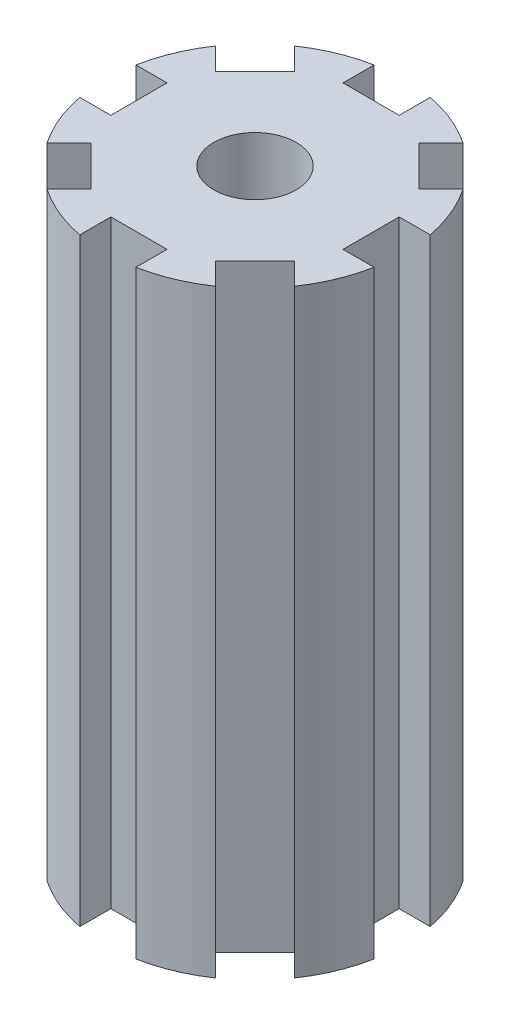
ISO-10303-21;
HEADER;
FILE_DESCRIPTION(('STEP AP214'),'2;1');
FILE_NAME('part.step','',(''),(''),'','','');
FILE_SCHEMA(('AUTOMOTIVE_DESIGN { 1 0 10303 214 1 1 1 1 }'));
ENDSEC;
DATA;
#1=APPLICATION_CONTEXT('core data for automotive mechanical design processes');
#2=APPLICATION_PROTOCOL_DEFINITION('international standard','automotive_design',2000,#1);
#3=PRODUCT_CONTEXT('',#1,'mechanical');
#4=PRODUCT('Part','Part','',(#3));
#5=PRODUCT_RELATED_PRODUCT_CATEGORY('part','',(#4));
#6=PRODUCT_DEFINITION_FORMATION('','',#4);
#7=PRODUCT_DEFINITION_CONTEXT('part definition',#1,'design');
#8=PRODUCT_DEFINITION('design','',#6,#7);
#9=PRODUCT_DEFINITION_SHAPE('','',#8);
#10=(LENGTH_UNIT() NAMED_UNIT(*) SI_UNIT(.MILLI.,.METRE.));
#11=(NAMED_UNIT(*) PLANE_ANGLE_UNIT() SI_UNIT($,.RADIAN.));
#12=(NAMED_UNIT(*) SI_UNIT($,.STERADIAN.) SOLID_ANGLE_UNIT());
#13=UNCERTAINTY_MEASURE_WITH_UNIT(LENGTH_MEASURE(1.E-05),#10,'distance_accuracy_value','');
#14=(GEOMETRIC_REPRESENTATION_CONTEXT(3) GLOBAL_UNCERTAINTY_ASSIGNED_CONTEXT((#13)) GLOBAL_UNIT_ASSIGNED_CONTEXT((#10,
#11,#12)) REPRESENTATION_CONTEXT('',''));
#15=CARTESIAN_POINT('',(0.,0.,0.));
#16=DIRECTION('',(0.,0.,1.));
#17=DIRECTION('',(1.,0.,0.));
#18=AXIS2_PLACEMENT_3D('',#15,#16,#17);
#19=CARTESIAN_POINT('',(0.,-50.8,0.));
#20=DIRECTION('',(0.,1.,0.));
#21=DIRECTION('',(0.,0.,1.));
#22=AXIS2_PLACEMENT_3D('',#19,#20,#21);
#23=CYLINDRICAL_SURFACE('',#22,12.7);
#24=DIRECTION('',(0.,1.,0.));
#25=VECTOR('',#24,1.);
#26=CARTESIAN_POINT('',(7.13718968949764,-50.8,-10.5047857348986));
#27=LINE('',#26,#25);
#28=CARTESIAN_POINT('',(7.13718968949764,-50.8,-10.5047857348986));
#29=VERTEX_POINT('',#28);
#30=CARTESIAN_POINT('',(7.13718968949764,0.,-10.5047857348986));
#31=VERTEX_POINT('',#30);
#32=EDGE_CURVE('E516',#29,#31,#27,.T.);
#33=ORIENTED_EDGE('',*,*,#32,.F.);
#34=CARTESIAN_POINT('',(0.,-50.8,0.));
#35=DIRECTION('',(0.,1.,0.));
#36=DIRECTION('',(0.,0.,1.));
#37=AXIS2_PLACEMENT_3D('',#34,#35,#36);
#38=CIRCLE('',#37,12.7);
#39=CARTESIAN_POINT('',(2.38125,-50.8,-12.474760456117));
#40=VERTEX_POINT('',#39);
#41=EDGE_CURVE('E660',#29,#40,#38,.T.);
#42=ORIENTED_EDGE('',*,*,#41,.T.);
#43=DIRECTION('',(0.,1.,0.));
#44=VECTOR('',#43,1.);
#45=CARTESIAN_POINT('',(2.38125,-50.8,-12.474760456117));
#46=LINE('',#45,#44);
#47=CARTESIAN_POINT('',(2.38125,0.,-12.474760456117));
#48=VERTEX_POINT('',#47);
#49=EDGE_CURVE('E491',#48,#40,#46,.F.);
#50=ORIENTED_EDGE('',*,*,#49,.F.);
#51=CARTESIAN_POINT('',(0.,0.,0.));
#52=DIRECTION('',(0.,1.,0.));
#53=DIRECTION('',(0.,0.,1.));
#54=AXIS2_PLACEMENT_3D('',#51,#52,#53);
#55=CIRCLE('',#54,12.7);
#56=EDGE_CURVE('E579',#31,#48,#55,.T.);
#57=ORIENTED_EDGE('',*,*,#56,.F.);
#58=EDGE_LOOP('',(#33,#42,#50,#57));
#59=FACE_BOUND('',#58,.T.);
#60=ADVANCED_FACE('F39',(#59),#23,.T.);
#61=DIRECTION('',(0.,1.,0.));
#62=VECTOR('',#61,1.);
#63=CARTESIAN_POINT('',(-2.38125,-50.8,-12.474760456117));
#64=LINE('',#63,#62);
#65=CARTESIAN_POINT('',(-2.38125,-50.8,-12.474760456117));
#66=VERTEX_POINT('',#65);
#67=CARTESIAN_POINT('',(-2.38125,0.,-12.474760456117));
#68=VERTEX_POINT('',#67);
#69=EDGE_CURVE('E498',#66,#68,#64,.T.);
#70=ORIENTED_EDGE('',*,*,#69,.F.);
#71=CARTESIAN_POINT('',(-7.13718968949764,-50.8,-10.5047857348986));
#72=VERTEX_POINT('',#71);
#73=EDGE_CURVE('E572',#66,#72,#38,.T.);
#74=ORIENTED_EDGE('',*,*,#73,.T.);
#75=DIRECTION('',(0.,1.,0.));
#76=VECTOR('',#75,1.);
#77=CARTESIAN_POINT('',(-7.13718968949764,-50.8,-10.5047857348986));
#78=LINE('',#77,#76);
#79=CARTESIAN_POINT('',(-7.13718968949764,0.,-10.5047857348986));
#80=VERTEX_POINT('',#79);
#81=EDGE_CURVE('E473',#80,#72,#78,.F.);
#82=ORIENTED_EDGE('',*,*,#81,.F.);
#83=EDGE_CURVE('E576',#68,#80,#55,.T.);
#84=ORIENTED_EDGE('',*,*,#83,.F.);
#85=EDGE_LOOP('',(#70,#74,#82,#84));
#86=FACE_BOUND('',#85,.T.);
#87=ADVANCED_FACE('F574',(#86),#23,.T.);
#88=DIRECTION('',(0.,1.,0.));
#89=VECTOR('',#88,1.);
#90=CARTESIAN_POINT('',(-10.5047857348986,-50.8,-7.13718968949764));
#91=LINE('',#90,#89);
#92=CARTESIAN_POINT('',(-10.5047857348986,-50.8,-7.13718968949764));
#93=VERTEX_POINT('',#92);
#94=CARTESIAN_POINT('',(-10.5047857348986,0.,-7.13718968949764));
#95=VERTEX_POINT('',#94);
#96=EDGE_CURVE('E480',#93,#95,#91,.T.);
#97=ORIENTED_EDGE('',*,*,#96,.F.);
#98=CARTESIAN_POINT('',(-12.474760456117,-50.8,-2.38125));
#99=VERTEX_POINT('',#98);
#100=EDGE_CURVE('E970',#93,#99,#38,.T.);
#101=ORIENTED_EDGE('',*,*,#100,.T.);
#102=DIRECTION('',(0.,1.,0.));
#103=VECTOR('',#102,1.);
#104=CARTESIAN_POINT('',(-12.474760456117,-50.8,-2.38125));
#105=LINE('',#104,#103);
#106=CARTESIAN_POINT('',(-12.474760456117,0.,-2.38125));
#107=VERTEX_POINT('',#106);
#108=EDGE_CURVE('E382',#107,#99,#105,.F.);
#109=ORIENTED_EDGE('',*,*,#108,.F.);
#110=EDGE_CURVE('E580',#95,#107,#55,.T.);
#111=ORIENTED_EDGE('',*,*,#110,.F.);
#112=EDGE_LOOP('',(#97,#101,#109,#111));
#113=FACE_BOUND('',#112,.T.);
#114=ADVANCED_FACE('F676',(#113),#23,.T.);
#115=DIRECTION('',(0.,1.,0.));
#116=VECTOR('',#115,1.);
#117=CARTESIAN_POINT('',(10.5047857348986,-50.8,-7.13718968949764));
#118=LINE('',#117,#116);
#119=CARTESIAN_POINT('',(10.5047857348986,0.,-7.13718968949764));
#120=VERTEX_POINT('',#119);
#121=CARTESIAN_POINT('',(10.5047857348986,-50.8,-7.13718968949764));
#122=VERTEX_POINT('',#121);
#123=EDGE_CURVE('E509',#120,#122,#118,.F.);
#124=ORIENTED_EDGE('',*,*,#123,.F.);
#125=CARTESIAN_POINT('',(12.474760456117,0.,-2.38125));
#126=VERTEX_POINT('',#125);
#127=EDGE_CURVE('E583',#126,#120,#55,.T.);
#128=ORIENTED_EDGE('',*,*,#127,.F.);
#129=DIRECTION('',(0.,1.,0.));
#130=VECTOR('',#129,1.);
#131=CARTESIAN_POINT('',(12.474760456117,-50.8,-2.38125));
#132=LINE('',#131,#130);
#133=CARTESIAN_POINT('',(12.474760456117,-50.8,-2.38125));
#134=VERTEX_POINT('',#133);
#135=EDGE_CURVE('E458',#134,#126,#132,.T.);
#136=ORIENTED_EDGE('',*,*,#135,.F.);
#137=EDGE_CURVE('E649',#134,#122,#38,.T.);
#138=ORIENTED_EDGE('',*,*,#137,.T.);
#139=EDGE_LOOP('',(#124,#128,#136,#138));
#140=FACE_BOUND('',#139,.T.);
#141=ADVANCED_FACE('F646',(#140),#23,.T.);
#142=DIRECTION('',(0.,1.,0.));
#143=VECTOR('',#142,1.);
#144=CARTESIAN_POINT('',(12.474760456117,-50.8,2.38125));
#145=LINE('',#144,#143);
#146=CARTESIAN_POINT('',(12.474760456117,0.,2.38125));
#147=VERTEX_POINT('',#146);
#148=CARTESIAN_POINT('',(12.474760456117,-50.8,2.38125));
#149=VERTEX_POINT('',#148);
#150=EDGE_CURVE('E451',#147,#149,#145,.F.);
#151=ORIENTED_EDGE('',*,*,#150,.F.);
#152=CARTESIAN_POINT('',(10.5047857348986,0.,7.13718968949764));
#153=VERTEX_POINT('',#152);
#154=EDGE_CURVE('E279',#153,#147,#55,.T.);
#155=ORIENTED_EDGE('',*,*,#154,.F.);
#156=DIRECTION('',(0.,1.,0.));
#157=VECTOR('',#156,1.);
#158=CARTESIAN_POINT('',(10.5047857348986,-50.8,7.13718968949764));
#159=LINE('',#158,#157);
#160=CARTESIAN_POINT('',(10.5047857348986,-50.8,7.13718968949764));
#161=VERTEX_POINT('',#160);
#162=EDGE_CURVE('E443',#161,#153,#159,.T.);
#163=ORIENTED_EDGE('',*,*,#162,.F.);
#164=EDGE_CURVE('E525',#161,#149,#38,.T.);
#165=ORIENTED_EDGE('',*,*,#164,.T.);
#166=EDGE_LOOP('',(#151,#155,#163,#165));
#167=FACE_BOUND('',#166,.T.);
#168=ADVANCED_FACE('F635',(#167),#23,.T.);
#169=DIRECTION('',(0.,1.,0.));
#170=VECTOR('',#169,1.);
#171=CARTESIAN_POINT('',(7.13718968949764,-50.8,10.5047857348986));
#172=LINE('',#171,#170);
#173=CARTESIAN_POINT('',(7.13718968949764,0.,10.5047857348986));
#174=VERTEX_POINT('',#173);
#175=CARTESIAN_POINT('',(7.13718968949764,-50.8,10.5047857348986));
#176=VERTEX_POINT('',#175);
#177=EDGE_CURVE('E436',#174,#176,#172,.F.);
#178=ORIENTED_EDGE('',*,*,#177,.F.);
#179=CARTESIAN_POINT('',(2.38125,0.,12.474760456117));
#180=VERTEX_POINT('',#179);
#181=EDGE_CURVE('E527',#180,#174,#55,.T.);
#182=ORIENTED_EDGE('',*,*,#181,.F.);
#183=DIRECTION('',(0.,1.,0.));
#184=VECTOR('',#183,1.);
#185=CARTESIAN_POINT('',(2.38125,-50.8,12.474760456117));
#186=LINE('',#185,#184);
#187=CARTESIAN_POINT('',(2.38125,-50.8,12.474760456117));
#188=VERTEX_POINT('',#187);
#189=EDGE_CURVE('E425',#188,#180,#186,.T.);
#190=ORIENTED_EDGE('',*,*,#189,.F.);
#191=EDGE_CURVE('E520',#188,#176,#38,.T.);
#192=ORIENTED_EDGE('',*,*,#191,.T.);
#193=EDGE_LOOP('',(#178,#182,#190,#192));
#194=FACE_BOUND('',#193,.T.);
#195=ADVANCED_FACE('F622',(#194),#23,.T.);
#196=DIRECTION('',(0.,1.,0.));
#197=VECTOR('',#196,1.);
#198=CARTESIAN_POINT('',(-2.38125,-50.8,12.474760456117));
#199=LINE('',#198,#197);
#200=CARTESIAN_POINT('',(-2.38125,0.,12.474760456117));
#201=VERTEX_POINT('',#200);
#202=CARTESIAN_POINT('',(-2.38125,-50.8,12.474760456117));
#203=VERTEX_POINT('',#202);
#204=EDGE_CURVE('E418',#201,#203,#199,.F.);
#205=ORIENTED_EDGE('',*,*,#204,.F.);
#206=CARTESIAN_POINT('',(-7.13718968949764,0.,10.5047857348986));
#207=VERTEX_POINT('',#206);
#208=EDGE_CURVE('E519',#207,#201,#55,.T.);
#209=ORIENTED_EDGE('',*,*,#208,.F.);
#210=DIRECTION('',(0.,1.,0.));
#211=VECTOR('',#210,1.);
#212=CARTESIAN_POINT('',(-7.13718968949764,-50.8,10.5047857348986));
#213=LINE('',#212,#211);
#214=CARTESIAN_POINT('',(-7.13718968949764,-50.8,10.5047857348986));
#215=VERTEX_POINT('',#214);
#216=EDGE_CURVE('E407',#215,#207,#213,.T.);
#217=ORIENTED_EDGE('',*,*,#216,.F.);
#218=EDGE_CURVE('E526',#215,#203,#38,.T.);
#219=ORIENTED_EDGE('',*,*,#218,.T.);
#220=EDGE_LOOP('',(#205,#209,#217,#219));
#221=FACE_BOUND('',#220,.T.);
#222=ADVANCED_FACE('F604',(#221),#23,.T.);
#223=DIRECTION('',(0.,1.,0.));
#224=VECTOR('',#223,1.);
#225=CARTESIAN_POINT('',(-10.5047857348986,-50.8,7.13718968949764));
#226=LINE('',#225,#224);
#227=CARTESIAN_POINT('',(-10.5047857348986,0.,7.13718968949764));
#228=VERTEX_POINT('',#227);
#229=CARTESIAN_POINT('',(-10.5047857348986,-50.8,7.13718968949764));
#230=VERTEX_POINT('',#229);
#231=EDGE_CURVE('E400',#228,#230,#226,.F.);
#232=ORIENTED_EDGE('',*,*,#231,.F.);
#233=CARTESIAN_POINT('',(-12.474760456117,0.,2.38125));
#234=VERTEX_POINT('',#233);
#235=EDGE_CURVE('E585',#234,#228,#55,.T.);
#236=ORIENTED_EDGE('',*,*,#235,.F.);
#237=DIRECTION('',(0.,1.,0.));
#238=VECTOR('',#237,1.);
#239=CARTESIAN_POINT('',(-12.474760456117,-50.8,2.38125));
#240=LINE('',#239,#238);
#241=CARTESIAN_POINT('',(-12.474760456117,-50.8,2.38125));
#242=VERTEX_POINT('',#241);
#243=EDGE_CURVE('E389',#242,#234,#240,.T.);
#244=ORIENTED_EDGE('',*,*,#243,.F.);
#245=EDGE_CURVE('E688',#242,#230,#38,.T.);
#246=ORIENTED_EDGE('',*,*,#245,.T.);
#247=EDGE_LOOP('',(#232,#236,#244,#246));
#248=FACE_BOUND('',#247,.T.);
#249=ADVANCED_FACE('F41',(#248),#23,.T.);
#250=CARTESIAN_POINT('',(0.,-50.8,0.));
#251=DIRECTION('',(0.,1.,0.));
#252=DIRECTION('',(0.,0.,1.));
#253=AXIS2_PLACEMENT_3D('',#250,#251,#252);
#254=PLANE('',#253);
#255=ORIENTED_EDGE('',*,*,#41,.F.);
#256=DIRECTION('',(-0.707106781186547,0.,0.707106781186548));
#257=VECTOR('',#256,1.);
#258=CARTESIAN_POINT('',(-1.68379802270047,-50.8,-1.68379802270047));
#259=LINE('',#258,#257);
#260=CARTESIAN_POINT('',(5.27590047112812,-50.8,-8.64349651652906));
#261=VERTEX_POINT('',#260);
#262=EDGE_CURVE('E512',#29,#261,#259,.T.);
#263=ORIENTED_EDGE('',*,*,#262,.T.);
#264=DIRECTION('',(0.707106781186548,0.,0.707106781186548));
#265=VECTOR('',#264,1.);
#266=CARTESIAN_POINT('',(6.95969849382859,-50.8,-6.95969849382859));
#267=LINE('',#266,#265);
#268=CARTESIAN_POINT('',(8.64349651652905,-50.8,-5.27590047112813));
#269=VERTEX_POINT('',#268);
#270=EDGE_CURVE('E501',#261,#269,#267,.T.);
#271=ORIENTED_EDGE('',*,*,#270,.T.);
#272=DIRECTION('',(0.707106781186548,0.,-0.707106781186547));
#273=VECTOR('',#272,1.);
#274=CARTESIAN_POINT('',(1.68379802270046,-50.8,1.68379802270046));
#275=LINE('',#274,#273);
#276=EDGE_CURVE('E505',#269,#122,#275,.T.);
#277=ORIENTED_EDGE('',*,*,#276,.T.);
#278=ORIENTED_EDGE('',*,*,#137,.F.);
#279=DIRECTION('',(-1.,0.,0.));
#280=VECTOR('',#279,1.);
#281=CARTESIAN_POINT('',(0.,-50.8,-2.38125));
#282=LINE('',#281,#280);
#283=CARTESIAN_POINT('',(9.8425,-50.8,-2.38125));
#284=VERTEX_POINT('',#283);
#285=EDGE_CURVE('E454',#134,#284,#282,.T.);
#286=ORIENTED_EDGE('',*,*,#285,.T.);
#287=DIRECTION('',(0.,0.,1.));
#288=VECTOR('',#287,1.);
#289=CARTESIAN_POINT('',(9.8425,-50.8,0.));
#290=LINE('',#289,#288);
#291=CARTESIAN_POINT('',(9.8425,-50.8,2.38125));
#292=VERTEX_POINT('',#291);
#293=EDGE_CURVE('E446',#284,#292,#290,.T.);
#294=ORIENTED_EDGE('',*,*,#293,.T.);
#295=DIRECTION('',(1.,0.,0.));
#296=VECTOR('',#295,1.);
#297=CARTESIAN_POINT('',(0.,-50.8,2.38125));
#298=LINE('',#297,#296);
#299=EDGE_CURVE('E256',#292,#149,#298,.T.);
#300=ORIENTED_EDGE('',*,*,#299,.T.);
#301=ORIENTED_EDGE('',*,*,#164,.F.);
#302=DIRECTION('',(-0.707106781186548,0.,-0.707106781186547));
#303=VECTOR('',#302,1.);
#304=CARTESIAN_POINT('',(1.68379802270046,-50.8,-1.68379802270047));
#305=LINE('',#304,#303);
#306=CARTESIAN_POINT('',(8.64349651652906,-50.8,5.27590047112812));
#307=VERTEX_POINT('',#306);
#308=EDGE_CURVE('E439',#161,#307,#305,.T.);
#309=ORIENTED_EDGE('',*,*,#308,.T.);
#310=DIRECTION('',(-0.707106781186548,0.,0.707106781186548));
#311=VECTOR('',#310,1.);
#312=CARTESIAN_POINT('',(6.95969849382859,-50.8,6.95969849382859));
#313=LINE('',#312,#311);
#314=CARTESIAN_POINT('',(5.27590047112812,-50.8,8.64349651652906));
#315=VERTEX_POINT('',#314);
#316=EDGE_CURVE('E428',#307,#315,#313,.T.);
#317=ORIENTED_EDGE('',*,*,#316,.T.);
#318=DIRECTION('',(0.707106781186547,0.,0.707106781186548));
#319=VECTOR('',#318,1.);
#320=CARTESIAN_POINT('',(-1.68379802270047,-50.8,1.68379802270046));
#321=LINE('',#320,#319);
#322=EDGE_CURVE('E432',#315,#176,#321,.T.);
#323=ORIENTED_EDGE('',*,*,#322,.T.);
#324=ORIENTED_EDGE('',*,*,#191,.F.);
#325=DIRECTION('',(0.,0.,-1.));
#326=VECTOR('',#325,1.);
#327=CARTESIAN_POINT('',(2.38125,-50.8,0.));
#328=LINE('',#327,#326);
#329=CARTESIAN_POINT('',(2.38125,-50.8,9.8425));
#330=VERTEX_POINT('',#329);
#331=EDGE_CURVE('E421',#188,#330,#328,.T.);
#332=ORIENTED_EDGE('',*,*,#331,.T.);
#333=DIRECTION('',(-1.,0.,0.));
#334=VECTOR('',#333,1.);
#335=CARTESIAN_POINT('',(0.,-50.8,9.8425));
#336=LINE('',#335,#334);
#337=CARTESIAN_POINT('',(-2.38125,-50.8,9.8425));
#338=VERTEX_POINT('',#337);
#339=EDGE_CURVE('E410',#330,#338,#336,.T.);
#340=ORIENTED_EDGE('',*,*,#339,.T.);
#341=DIRECTION('',(0.,0.,1.));
#342=VECTOR('',#341,1.);
#343=CARTESIAN_POINT('',(-2.38125,-50.8,0.));
#344=LINE('',#343,#342);
#345=EDGE_CURVE('E414',#338,#203,#344,.T.);
#346=ORIENTED_EDGE('',*,*,#345,.T.);
#347=ORIENTED_EDGE('',*,*,#218,.F.);
#348=DIRECTION('',(0.707106781186547,0.,-0.707106781186548));
#349=VECTOR('',#348,1.);
#350=CARTESIAN_POINT('',(1.68379802270046,-50.8,1.68379802270046));
#351=LINE('',#350,#349);
#352=CARTESIAN_POINT('',(-5.27590047112813,-50.8,8.64349651652906));
#353=VERTEX_POINT('',#352);
#354=EDGE_CURVE('E403',#215,#353,#351,.T.);
#355=ORIENTED_EDGE('',*,*,#354,.T.);
#356=DIRECTION('',(-0.707106781186548,0.,-0.707106781186547));
#357=VECTOR('',#356,1.);
#358=CARTESIAN_POINT('',(-6.95969849382859,-50.8,6.9596984938286));
#359=LINE('',#358,#357);
#360=CARTESIAN_POINT('',(-8.64349651652906,-50.8,5.27590047112813));
#361=VERTEX_POINT('',#360);
#362=EDGE_CURVE('E392',#353,#361,#359,.T.);
#363=ORIENTED_EDGE('',*,*,#362,.T.);
#364=DIRECTION('',(-0.707106781186548,0.,0.707106781186548));
#365=VECTOR('',#364,1.);
#366=CARTESIAN_POINT('',(-1.68379802270047,-50.8,-1.68379802270047));
#367=LINE('',#366,#365);
#368=EDGE_CURVE('E396',#361,#230,#367,.T.);
#369=ORIENTED_EDGE('',*,*,#368,.T.);
#370=ORIENTED_EDGE('',*,*,#245,.F.);
#371=DIRECTION('',(1.,0.,0.));
#372=VECTOR('',#371,1.);
#373=CARTESIAN_POINT('',(0.,-50.8,2.38125));
#374=LINE('',#373,#372);
#375=CARTESIAN_POINT('',(-9.8425,-50.8,2.38125));
#376=VERTEX_POINT('',#375);
#377=EDGE_CURVE('E385',#242,#376,#374,.T.);
#378=ORIENTED_EDGE('',*,*,#377,.T.);
#379=DIRECTION('',(0.,0.,-1.));
#380=VECTOR('',#379,1.);
#381=CARTESIAN_POINT('',(-9.8425,-50.8,0.));
#382=LINE('',#381,#380);
#383=CARTESIAN_POINT('',(-9.8425,-50.8,-2.38125));
#384=VERTEX_POINT('',#383);
#385=EDGE_CURVE('E372',#376,#384,#382,.T.);
#386=ORIENTED_EDGE('',*,*,#385,.T.);
#387=DIRECTION('',(-1.,0.,0.));
#388=VECTOR('',#387,1.);
#389=CARTESIAN_POINT('',(0.,-50.8,-2.38125));
#390=LINE('',#389,#388);
#391=EDGE_CURVE('E378',#384,#99,#390,.T.);
#392=ORIENTED_EDGE('',*,*,#391,.T.);
#393=ORIENTED_EDGE('',*,*,#100,.F.);
#394=DIRECTION('',(0.707106781186548,0.,0.707106781186547));
#395=VECTOR('',#394,1.);
#396=CARTESIAN_POINT('',(-1.68379802270047,-50.8,1.68379802270047));
#397=LINE('',#396,#395);
#398=CARTESIAN_POINT('',(-8.64349651652906,-50.8,-5.27590047112813));
#399=VERTEX_POINT('',#398);
#400=EDGE_CURVE('E476',#93,#399,#397,.T.);
#401=ORIENTED_EDGE('',*,*,#400,.T.);
#402=DIRECTION('',(0.707106781186547,0.,-0.707106781186548));
#403=VECTOR('',#402,1.);
#404=CARTESIAN_POINT('',(-6.9596984938286,-50.8,-6.95969849382859));
#405=LINE('',#404,#403);
#406=CARTESIAN_POINT('',(-5.27590047112813,-50.8,-8.64349651652906));
#407=VERTEX_POINT('',#406);
#408=EDGE_CURVE('E465',#399,#407,#405,.T.);
#409=ORIENTED_EDGE('',*,*,#408,.T.);
#410=DIRECTION('',(-0.707106781186547,0.,-0.707106781186548));
#411=VECTOR('',#410,1.);
#412=CARTESIAN_POINT('',(1.68379802270046,-50.8,-1.68379802270046));
#413=LINE('',#412,#411);
#414=EDGE_CURVE('E469',#407,#72,#413,.T.);
#415=ORIENTED_EDGE('',*,*,#414,.T.);
#416=ORIENTED_EDGE('',*,*,#73,.F.);
#417=DIRECTION('',(0.,0.,1.));
#418=VECTOR('',#417,1.);
#419=CARTESIAN_POINT('',(-2.38125,-50.8,0.));
#420=LINE('',#419,#418);
#421=CARTESIAN_POINT('',(-2.38125,-50.8,-9.8425));
#422=VERTEX_POINT('',#421);
#423=EDGE_CURVE('E494',#66,#422,#420,.T.);
#424=ORIENTED_EDGE('',*,*,#423,.T.);
#425=DIRECTION('',(1.,0.,0.));
#426=VECTOR('',#425,1.);
#427=CARTESIAN_POINT('',(0.,-50.8,-9.8425));
#428=LINE('',#427,#426);
#429=CARTESIAN_POINT('',(2.38125,-50.8,-9.8425));
#430=VERTEX_POINT('',#429);
#431=EDGE_CURVE('E483',#422,#430,#428,.T.);
#432=ORIENTED_EDGE('',*,*,#431,.T.);
#433=DIRECTION('',(0.,0.,-1.));
#434=VECTOR('',#433,1.);
#435=CARTESIAN_POINT('',(2.38125,-50.8,0.));
#436=LINE('',#435,#434);
#437=EDGE_CURVE('E487',#430,#40,#436,.T.);
#438=ORIENTED_EDGE('',*,*,#437,.T.);
#439=EDGE_LOOP('',(#255,#263,#271,#277,#278,#286,#294,#300,#301,#309,#317,#323,#324,#332,#340,
#346,#347,#355,#363,#369,#370,#378,#386,#392,#393,#401,#409,#415,#416,#424,#432,#438));
#440=FACE_BOUND('',#439,.T.);
#441=CARTESIAN_POINT('',(0.,-50.8,0.));
#442=DIRECTION('',(0.,1.,0.));
#443=DIRECTION('',(0.,0.,1.));
#444=AXIS2_PLACEMENT_3D('',#441,#442,#443);
#445=CIRCLE('',#444,3.4925);
#446=CARTESIAN_POINT('',(0.,-50.8,3.4925));
#447=VERTEX_POINT('',#446);
#448=EDGE_CURVE('E461',#447,#447,#445,.T.);
#449=ORIENTED_EDGE('',*,*,#448,.T.);
#450=EDGE_LOOP('',(#449));
#451=FACE_BOUND('',#450,.T.);
#452=ADVANCED_FACE('F567',(#440,#451),#254,.F.);
#453=CARTESIAN_POINT('',(0.,0.,0.));
#454=DIRECTION('',(0.,1.,0.));
#455=DIRECTION('',(0.,0.,1.));
#456=AXIS2_PLACEMENT_3D('',#453,#454,#455);
#457=PLANE('',#456);
#458=DIRECTION('',(-0.707106781186547,0.,0.707106781186548));
#459=VECTOR('',#458,1.);
#460=CARTESIAN_POINT('',(-1.68379802270047,0.,-1.68379802270046));
#461=LINE('',#460,#459);
#462=CARTESIAN_POINT('',(5.27590047112812,0.,-8.64349651652906));
#463=VERTEX_POINT('',#462);
#464=EDGE_CURVE('E11',#31,#463,#461,.T.);
#465=ORIENTED_EDGE('',*,*,#464,.F.);
#466=ORIENTED_EDGE('',*,*,#56,.T.);
#467=DIRECTION('',(0.,0.,-1.));
#468=VECTOR('',#467,1.);
#469=CARTESIAN_POINT('',(2.38125,0.,-9.8425));
#470=LINE('',#469,#468);
#471=CARTESIAN_POINT('',(2.38125,0.,-9.8425));
#472=VERTEX_POINT('',#471);
#473=EDGE_CURVE('E326',#472,#48,#470,.T.);
#474=ORIENTED_EDGE('',*,*,#473,.F.);
#475=DIRECTION('',(1.,0.,0.));
#476=VECTOR('',#475,1.);
#477=CARTESIAN_POINT('',(2.38125,0.,-9.8425));
#478=LINE('',#477,#476);
#479=CARTESIAN_POINT('',(-2.38125000000001,0.,-9.8425));
#480=VERTEX_POINT('',#479);
#481=EDGE_CURVE('E323',#480,#472,#478,.T.);
#482=ORIENTED_EDGE('',*,*,#481,.F.);
#483=DIRECTION('',(0.,0.,1.));
#484=VECTOR('',#483,1.);
#485=CARTESIAN_POINT('',(-2.38125,0.,0.));
#486=LINE('',#485,#484);
#487=EDGE_CURVE('E48',#68,#480,#486,.T.);
#488=ORIENTED_EDGE('',*,*,#487,.F.);
#489=ORIENTED_EDGE('',*,*,#83,.T.);
#490=DIRECTION('',(-0.707106781186547,0.,-0.707106781186548));
#491=VECTOR('',#490,1.);
#492=CARTESIAN_POINT('',(-5.27590047112813,0.,-8.64349651652906));
#493=LINE('',#492,#491);
#494=CARTESIAN_POINT('',(-5.27590047112813,0.,-8.64349651652906));
#495=VERTEX_POINT('',#494);
#496=EDGE_CURVE('E354',#495,#80,#493,.T.);
#497=ORIENTED_EDGE('',*,*,#496,.F.);
#498=DIRECTION('',(0.707106781186547,0.,-0.707106781186548));
#499=VECTOR('',#498,1.);
#500=CARTESIAN_POINT('',(-5.27590047112813,0.,-8.64349651652906));
#501=LINE('',#500,#499);
#502=CARTESIAN_POINT('',(-8.64349651652906,0.,-5.27590047112813));
#503=VERTEX_POINT('',#502);
#504=EDGE_CURVE('E333',#503,#495,#501,.T.);
#505=ORIENTED_EDGE('',*,*,#504,.F.);
#506=DIRECTION('',(0.707106781186548,0.,0.707106781186547));
#507=VECTOR('',#506,1.);
#508=CARTESIAN_POINT('',(-1.68379802270047,0.,1.68379802270047));
#509=LINE('',#508,#507);
#510=EDGE_CURVE('E549',#95,#503,#509,.T.);
#511=ORIENTED_EDGE('',*,*,#510,.F.);
#512=ORIENTED_EDGE('',*,*,#110,.T.);
#513=DIRECTION('',(-1.,0.,0.));
#514=VECTOR('',#513,1.);
#515=CARTESIAN_POINT('',(-9.8425,0.,-2.38125));
#516=LINE('',#515,#514);
#517=CARTESIAN_POINT('',(-9.8425,0.,-2.38125));
#518=VERTEX_POINT('',#517);
#519=EDGE_CURVE('E365',#518,#107,#516,.T.);
#520=ORIENTED_EDGE('',*,*,#519,.F.);
#521=DIRECTION('',(0.,0.,-1.));
#522=VECTOR('',#521,1.);
#523=CARTESIAN_POINT('',(-9.8425,0.,-2.38125));
#524=LINE('',#523,#522);
#525=CARTESIAN_POINT('',(-9.8425,0.,2.38125));
#526=VERTEX_POINT('',#525);
#527=EDGE_CURVE('E349',#526,#518,#524,.T.);
#528=ORIENTED_EDGE('',*,*,#527,.F.);
#529=DIRECTION('',(1.,0.,0.));
#530=VECTOR('',#529,1.);
#531=CARTESIAN_POINT('',(0.,0.,2.38125));
#532=LINE('',#531,#530);
#533=EDGE_CURVE('E524',#234,#526,#532,.T.);
#534=ORIENTED_EDGE('',*,*,#533,.F.);
#535=ORIENTED_EDGE('',*,*,#235,.T.);
#536=DIRECTION('',(-0.707106781186547,0.,0.707106781186547));
#537=VECTOR('',#536,1.);
#538=CARTESIAN_POINT('',(-8.64349651652906,0.,5.27590047112813));
#539=LINE('',#538,#537);
#540=CARTESIAN_POINT('',(-8.64349651652906,0.,5.27590047112813));
#541=VERTEX_POINT('',#540);
#542=EDGE_CURVE('E315',#541,#228,#539,.T.);
#543=ORIENTED_EDGE('',*,*,#542,.F.);
#544=DIRECTION('',(-0.707106781186548,0.,-0.707106781186547));
#545=VECTOR('',#544,1.);
#546=CARTESIAN_POINT('',(-8.64349651652906,0.,5.27590047112813));
#547=LINE('',#546,#545);
#548=CARTESIAN_POINT('',(-5.27590047112813,0.,8.64349651652906));
#549=VERTEX_POINT('',#548);
#550=EDGE_CURVE('E311',#549,#541,#547,.T.);
#551=ORIENTED_EDGE('',*,*,#550,.F.);
#552=DIRECTION('',(0.707106781186547,0.,-0.707106781186548));
#553=VECTOR('',#552,1.);
#554=CARTESIAN_POINT('',(1.68379802270047,0.,1.68379802270047));
#555=LINE('',#554,#553);
#556=EDGE_CURVE('E534',#207,#549,#555,.T.);
#557=ORIENTED_EDGE('',*,*,#556,.F.);
#558=ORIENTED_EDGE('',*,*,#208,.T.);
#559=DIRECTION('',(0.,0.,1.));
#560=VECTOR('',#559,1.);
#561=CARTESIAN_POINT('',(-2.38125,0.,9.8425));
#562=LINE('',#561,#560);
#563=CARTESIAN_POINT('',(-2.38125,0.,9.8425));
#564=VERTEX_POINT('',#563);
#565=EDGE_CURVE('E302',#564,#201,#562,.T.);
#566=ORIENTED_EDGE('',*,*,#565,.F.);
#567=DIRECTION('',(-1.,0.,0.));
#568=VECTOR('',#567,1.);
#569=CARTESIAN_POINT('',(-2.38125,0.,9.8425));
#570=LINE('',#569,#568);
#571=CARTESIAN_POINT('',(2.38125,0.,9.8425));
#572=VERTEX_POINT('',#571);
#573=EDGE_CURVE('E298',#572,#564,#570,.T.);
#574=ORIENTED_EDGE('',*,*,#573,.F.);
#575=DIRECTION('',(0.,0.,-1.));
#576=VECTOR('',#575,1.);
#577=CARTESIAN_POINT('',(2.38125,0.,0.));
#578=LINE('',#577,#576);
#579=EDGE_CURVE('E538',#180,#572,#578,.T.);
#580=ORIENTED_EDGE('',*,*,#579,.F.);
#581=ORIENTED_EDGE('',*,*,#181,.T.);
#582=DIRECTION('',(0.707106781186547,0.,0.707106781186548));
#583=VECTOR('',#582,1.);
#584=CARTESIAN_POINT('',(5.27590047112813,0.,8.64349651652906));
#585=LINE('',#584,#583);
#586=CARTESIAN_POINT('',(5.27590047112813,0.,8.64349651652906));
#587=VERTEX_POINT('',#586);
#588=EDGE_CURVE('E289',#587,#174,#585,.T.);
#589=ORIENTED_EDGE('',*,*,#588,.F.);
#590=DIRECTION('',(-0.707106781186547,0.,0.707106781186547));
#591=VECTOR('',#590,1.);
#592=CARTESIAN_POINT('',(5.27590047112813,0.,8.64349651652906));
#593=LINE('',#592,#591);
#594=CARTESIAN_POINT('',(8.64349651652906,0.,5.27590047112812));
#595=VERTEX_POINT('',#594);
#596=EDGE_CURVE('E285',#595,#587,#593,.T.);
#597=ORIENTED_EDGE('',*,*,#596,.F.);
#598=DIRECTION('',(-0.707106781186548,0.,-0.707106781186547));
#599=VECTOR('',#598,1.);
#600=CARTESIAN_POINT('',(1.68379802270047,0.,-1.68379802270047));
#601=LINE('',#600,#599);
#602=EDGE_CURVE('E542',#153,#595,#601,.T.);
#603=ORIENTED_EDGE('',*,*,#602,.F.);
#604=ORIENTED_EDGE('',*,*,#154,.T.);
#605=DIRECTION('',(1.,0.,0.));
#606=VECTOR('',#605,1.);
#607=CARTESIAN_POINT('',(9.8425,0.,2.38125));
#608=LINE('',#607,#606);
#609=CARTESIAN_POINT('',(9.8425,0.,2.38125));
#610=VERTEX_POINT('',#609);
#611=EDGE_CURVE('E253',#610,#147,#608,.T.);
#612=ORIENTED_EDGE('',*,*,#611,.F.);
#613=DIRECTION('',(0.,0.,1.));
#614=VECTOR('',#613,1.);
#615=CARTESIAN_POINT('',(9.8425,0.,2.38125));
#616=LINE('',#615,#614);
#617=CARTESIAN_POINT('',(9.8425,0.,-2.38125));
#618=VERTEX_POINT('',#617);
#619=EDGE_CURVE('E264',#618,#610,#616,.T.);
#620=ORIENTED_EDGE('',*,*,#619,.F.);
#621=DIRECTION('',(-1.,0.,0.));
#622=VECTOR('',#621,1.);
#623=CARTESIAN_POINT('',(0.,0.,-2.38125));
#624=LINE('',#623,#622);
#625=EDGE_CURVE('E546',#126,#618,#624,.T.);
#626=ORIENTED_EDGE('',*,*,#625,.F.);
#627=ORIENTED_EDGE('',*,*,#127,.T.);
#628=DIRECTION('',(0.707106781186548,0.,-0.707106781186547));
#629=VECTOR('',#628,1.);
#630=CARTESIAN_POINT('',(8.64349651652906,0.,-5.27590047112813));
#631=LINE('',#630,#629);
#632=CARTESIAN_POINT('',(8.64349651652906,0.,-5.27590047112813));
#633=VERTEX_POINT('',#632);
#634=EDGE_CURVE('E338',#633,#120,#631,.T.);
#635=ORIENTED_EDGE('',*,*,#634,.F.);
#636=DIRECTION('',(0.707106781186548,0.,0.707106781186548));
#637=VECTOR('',#636,1.);
#638=CARTESIAN_POINT('',(8.64349651652906,0.,-5.27590047112813));
#639=LINE('',#638,#637);
#640=EDGE_CURVE('E260',#463,#633,#639,.T.);
#641=ORIENTED_EDGE('',*,*,#640,.F.);
#642=EDGE_LOOP('',(#465,#466,#474,#482,#488,#489,#497,#505,#511,#512,#520,#528,#534,#535,#543,
#551,#557,#558,#566,#574,#580,#581,#589,#597,#603,#604,#612,#620,#626,#627,#635,#641));
#643=FACE_BOUND('',#642,.T.);
#644=CARTESIAN_POINT('',(0.,0.,0.));
#645=DIRECTION('',(0.,1.,0.));
#646=DIRECTION('',(-1.,0.,0.));
#647=AXIS2_PLACEMENT_3D('',#644,#645,#646);
#648=CIRCLE('',#647,3.4925);
#649=CARTESIAN_POINT('',(-3.4925,0.,0.));
#650=VERTEX_POINT('',#649);
#651=EDGE_CURVE('E345',#650,#650,#648,.T.);
#652=ORIENTED_EDGE('',*,*,#651,.F.);
#653=EDGE_LOOP('',(#652));
#654=FACE_BOUND('',#653,.T.);
#655=ADVANCED_FACE('F275',(#643,#654),#457,.T.);
#656=CARTESIAN_POINT('',(-9.84250000000001,-109.22,-2.38125));
#657=DIRECTION('',(1.,0.,0.));
#658=DIRECTION('',(0.,1.,0.));
#659=AXIS2_PLACEMENT_3D('',#656,#657,#658);
#660=PLANE('',#659);
#661=DIRECTION('',(0.,1.,0.));
#662=VECTOR('',#661,1.);
#663=CARTESIAN_POINT('',(-9.84250000000001,-109.22,2.38125));
#664=LINE('',#663,#662);
#665=EDGE_CURVE('E368',#376,#526,#664,.T.);
#666=ORIENTED_EDGE('',*,*,#665,.T.);
#667=ORIENTED_EDGE('',*,*,#527,.T.);
#668=DIRECTION('',(0.,1.,0.));
#669=VECTOR('',#668,1.);
#670=CARTESIAN_POINT('',(-9.84250000000001,-109.22,-2.38125));
#671=LINE('',#670,#669);
#672=EDGE_CURVE('E369',#384,#518,#671,.T.);
#673=ORIENTED_EDGE('',*,*,#672,.F.);
#674=ORIENTED_EDGE('',*,*,#385,.F.);
#675=EDGE_LOOP('',(#666,#667,#673,#674));
#676=FACE_BOUND('',#675,.T.);
#677=ADVANCED_FACE('F752',(#676),#660,.F.);
#678=CARTESIAN_POINT('',(-9.84250000000001,-109.22,2.38125));
#679=DIRECTION('',(0.,0.,1.));
#680=DIRECTION('',(1.,0.,0.));
#681=AXIS2_PLACEMENT_3D('',#678,#679,#680);
#682=PLANE('',#681);
#683=ORIENTED_EDGE('',*,*,#243,.T.);
#684=ORIENTED_EDGE('',*,*,#533,.T.);
#685=ORIENTED_EDGE('',*,*,#665,.F.);
#686=ORIENTED_EDGE('',*,*,#377,.F.);
#687=EDGE_LOOP('',(#683,#684,#685,#686));
#688=FACE_BOUND('',#687,.T.);
#689=ADVANCED_FACE('F750',(#688),#682,.F.);
#690=CARTESIAN_POINT('',(-9.84250000000001,-109.22,-2.38125));
#691=DIRECTION('',(0.,0.,-1.));
#692=DIRECTION('',(-1.,0.,0.));
#693=AXIS2_PLACEMENT_3D('',#690,#691,#692);
#694=PLANE('',#693);
#695=ORIENTED_EDGE('',*,*,#108,.T.);
#696=ORIENTED_EDGE('',*,*,#391,.F.);
#697=ORIENTED_EDGE('',*,*,#672,.T.);
#698=ORIENTED_EDGE('',*,*,#519,.T.);
#699=EDGE_LOOP('',(#695,#696,#697,#698));
#700=FACE_BOUND('',#699,.T.);
#701=ADVANCED_FACE('F703',(#700),#694,.F.);
#702=CARTESIAN_POINT('',(-8.64349651652907,-109.22,5.27590047112813));
#703=DIRECTION('',(0.707106781186547,0.,-0.707106781186548));
#704=DIRECTION('',(-0.707106781186548,0.,-0.707106781186547));
#705=AXIS2_PLACEMENT_3D('',#702,#703,#704);
#706=PLANE('',#705);
#707=DIRECTION('',(0.,1.,0.));
#708=VECTOR('',#707,1.);
#709=CARTESIAN_POINT('',(-5.27590047112813,-109.22,8.64349651652906));
#710=LINE('',#709,#708);
#711=EDGE_CURVE('E318',#353,#549,#710,.T.);
#712=ORIENTED_EDGE('',*,*,#711,.T.);
#713=ORIENTED_EDGE('',*,*,#550,.T.);
#714=DIRECTION('',(0.,1.,0.));
#715=VECTOR('',#714,1.);
#716=CARTESIAN_POINT('',(-8.64349651652907,-109.22,5.27590047112813));
#717=LINE('',#716,#715);
#718=EDGE_CURVE('E303',#361,#541,#717,.T.);
#719=ORIENTED_EDGE('',*,*,#718,.F.);
#720=ORIENTED_EDGE('',*,*,#362,.F.);
#721=EDGE_LOOP('',(#712,#713,#719,#720));
#722=FACE_BOUND('',#721,.T.);
#723=ADVANCED_FACE('F694',(#722),#706,.F.);
#724=CARTESIAN_POINT('',(-5.27590047112813,-109.22,8.64349651652906));
#725=DIRECTION('',(0.707106781186548,0.,0.707106781186547));
#726=DIRECTION('',(0.707106781186547,0.,-0.707106781186548));
#727=AXIS2_PLACEMENT_3D('',#724,#725,#726);
#728=PLANE('',#727);
#729=ORIENTED_EDGE('',*,*,#216,.T.);
#730=ORIENTED_EDGE('',*,*,#556,.T.);
#731=ORIENTED_EDGE('',*,*,#711,.F.);
#732=ORIENTED_EDGE('',*,*,#354,.F.);
#733=EDGE_LOOP('',(#729,#730,#731,#732));
#734=FACE_BOUND('',#733,.T.);
#735=ADVANCED_FACE('F696',(#734),#728,.F.);
#736=CARTESIAN_POINT('',(-8.64349651652907,-109.22,5.27590047112813));
#737=DIRECTION('',(-0.707106781186548,0.,-0.707106781186548));
#738=DIRECTION('',(-0.707106781186548,0.,0.707106781186548));
#739=AXIS2_PLACEMENT_3D('',#736,#737,#738);
#740=PLANE('',#739);
#741=ORIENTED_EDGE('',*,*,#231,.T.);
#742=ORIENTED_EDGE('',*,*,#368,.F.);
#743=ORIENTED_EDGE('',*,*,#718,.T.);
#744=ORIENTED_EDGE('',*,*,#542,.T.);
#745=EDGE_LOOP('',(#741,#742,#743,#744));
#746=FACE_BOUND('',#745,.T.);
#747=ADVANCED_FACE('F690',(#746),#740,.F.);
#748=CARTESIAN_POINT('',(-2.38125,-109.22,9.8425));
#749=DIRECTION('',(0.,0.,-1.));
#750=DIRECTION('',(-1.,0.,0.));
#751=AXIS2_PLACEMENT_3D('',#748,#749,#750);
#752=PLANE('',#751);
#753=DIRECTION('',(0.,1.,0.));
#754=VECTOR('',#753,1.);
#755=CARTESIAN_POINT('',(2.38125,-109.22,9.8425));
#756=LINE('',#755,#754);
#757=EDGE_CURVE('E306',#330,#572,#756,.T.);
#758=ORIENTED_EDGE('',*,*,#757,.T.);
#759=ORIENTED_EDGE('',*,*,#573,.T.);
#760=DIRECTION('',(0.,1.,0.));
#761=VECTOR('',#760,1.);
#762=CARTESIAN_POINT('',(-2.38125,-109.22,9.8425));
#763=LINE('',#762,#761);
#764=EDGE_CURVE('E290',#338,#564,#763,.T.);
#765=ORIENTED_EDGE('',*,*,#764,.F.);
#766=ORIENTED_EDGE('',*,*,#339,.F.);
#767=EDGE_LOOP('',(#758,#759,#765,#766));
#768=FACE_BOUND('',#767,.T.);
#769=ADVANCED_FACE('F613',(#768),#752,.F.);
#770=CARTESIAN_POINT('',(2.38125,-109.22,9.8425));
#771=DIRECTION('',(1.,0.,0.));
#772=DIRECTION('',(0.,0.,-1.));
#773=AXIS2_PLACEMENT_3D('',#770,#771,#772);
#774=PLANE('',#773);
#775=ORIENTED_EDGE('',*,*,#189,.T.);
#776=ORIENTED_EDGE('',*,*,#579,.T.);
#777=ORIENTED_EDGE('',*,*,#757,.F.);
#778=ORIENTED_EDGE('',*,*,#331,.F.);
#779=EDGE_LOOP('',(#775,#776,#777,#778));
#780=FACE_BOUND('',#779,.T.);
#781=ADVANCED_FACE('F615',(#780),#774,.F.);
#782=CARTESIAN_POINT('',(-2.38125,-109.22,9.8425));
#783=DIRECTION('',(-1.,0.,0.));
#784=DIRECTION('',(0.,0.,1.));
#785=AXIS2_PLACEMENT_3D('',#782,#783,#784);
#786=PLANE('',#785);
#787=ORIENTED_EDGE('',*,*,#204,.T.);
#788=ORIENTED_EDGE('',*,*,#345,.F.);
#789=ORIENTED_EDGE('',*,*,#764,.T.);
#790=ORIENTED_EDGE('',*,*,#565,.T.);
#791=EDGE_LOOP('',(#787,#788,#789,#790));
#792=FACE_BOUND('',#791,.T.);
#793=ADVANCED_FACE('F608',(#792),#786,.F.);
#794=CARTESIAN_POINT('',(5.27590047112812,-109.22,8.64349651652906));
#795=DIRECTION('',(-0.707106781186548,0.,-0.707106781186548));
#796=DIRECTION('',(-0.707106781186548,0.,0.707106781186548));
#797=AXIS2_PLACEMENT_3D('',#794,#795,#796);
#798=PLANE('',#797);
#799=DIRECTION('',(0.,1.,0.));
#800=VECTOR('',#799,1.);
#801=CARTESIAN_POINT('',(8.64349651652905,-109.22,5.27590047112812));
#802=LINE('',#801,#800);
#803=EDGE_CURVE('E293',#307,#595,#802,.T.);
#804=ORIENTED_EDGE('',*,*,#803,.T.);
#805=ORIENTED_EDGE('',*,*,#596,.T.);
#806=DIRECTION('',(0.,1.,0.));
#807=VECTOR('',#806,1.);
#808=CARTESIAN_POINT('',(5.27590047112812,-109.22,8.64349651652906));
#809=LINE('',#808,#807);
#810=EDGE_CURVE('E271',#315,#587,#809,.T.);
#811=ORIENTED_EDGE('',*,*,#810,.F.);
#812=ORIENTED_EDGE('',*,*,#316,.F.);
#813=EDGE_LOOP('',(#804,#805,#811,#812));
#814=FACE_BOUND('',#813,.T.);
#815=ADVANCED_FACE('F629',(#814),#798,.F.);
#816=CARTESIAN_POINT('',(8.64349651652905,-109.22,5.27590047112812));
#817=DIRECTION('',(0.707106781186547,0.,-0.707106781186548));
#818=DIRECTION('',(-0.707106781186548,0.,-0.707106781186547));
#819=AXIS2_PLACEMENT_3D('',#816,#817,#818);
#820=PLANE('',#819);
#821=ORIENTED_EDGE('',*,*,#162,.T.);
#822=ORIENTED_EDGE('',*,*,#602,.T.);
#823=ORIENTED_EDGE('',*,*,#803,.F.);
#824=ORIENTED_EDGE('',*,*,#308,.F.);
#825=EDGE_LOOP('',(#821,#822,#823,#824));
#826=FACE_BOUND('',#825,.T.);
#827=ADVANCED_FACE('F631',(#826),#820,.F.);
#828=CARTESIAN_POINT('',(5.27590047112812,-109.22,8.64349651652906));
#829=DIRECTION('',(-0.707106781186548,0.,0.707106781186547));
#830=DIRECTION('',(0.707106781186547,0.,0.707106781186548));
#831=AXIS2_PLACEMENT_3D('',#828,#829,#830);
#832=PLANE('',#831);
#833=ORIENTED_EDGE('',*,*,#177,.T.);
#834=ORIENTED_EDGE('',*,*,#322,.F.);
#835=ORIENTED_EDGE('',*,*,#810,.T.);
#836=ORIENTED_EDGE('',*,*,#588,.T.);
#837=EDGE_LOOP('',(#833,#834,#835,#836));
#838=FACE_BOUND('',#837,.T.);
#839=ADVANCED_FACE('F624',(#838),#832,.F.);
#840=CARTESIAN_POINT('',(9.84249999999999,-109.22,2.38125));
#841=DIRECTION('',(-1.,0.,0.));
#842=DIRECTION('',(0.,-1.,0.));
#843=AXIS2_PLACEMENT_3D('',#840,#841,#842);
#844=PLANE('',#843);
#845=DIRECTION('',(0.,1.,0.));
#846=VECTOR('',#845,1.);
#847=CARTESIAN_POINT('',(9.84249999999999,-109.22,-2.38125));
#848=LINE('',#847,#846);
#849=EDGE_CURVE('E261',#284,#618,#848,.T.);
#850=ORIENTED_EDGE('',*,*,#849,.T.);
#851=ORIENTED_EDGE('',*,*,#619,.T.);
#852=DIRECTION('',(0.,1.,0.));
#853=VECTOR('',#852,1.);
#854=CARTESIAN_POINT('',(9.84249999999999,-109.22,2.38125));
#855=LINE('',#854,#853);
#856=EDGE_CURVE('E249',#292,#610,#855,.T.);
#857=ORIENTED_EDGE('',*,*,#856,.F.);
#858=ORIENTED_EDGE('',*,*,#293,.F.);
#859=EDGE_LOOP('',(#850,#851,#857,#858));
#860=FACE_BOUND('',#859,.T.);
#861=ADVANCED_FACE('F265',(#860),#844,.F.);
#862=CARTESIAN_POINT('',(9.84249999999999,-109.22,-2.38125));
#863=DIRECTION('',(0.,0.,-1.));
#864=DIRECTION('',(-1.,0.,0.));
#865=AXIS2_PLACEMENT_3D('',#862,#863,#864);
#866=PLANE('',#865);
#867=ORIENTED_EDGE('',*,*,#135,.T.);
#868=ORIENTED_EDGE('',*,*,#625,.T.);
#869=ORIENTED_EDGE('',*,*,#849,.F.);
#870=ORIENTED_EDGE('',*,*,#285,.F.);
#871=EDGE_LOOP('',(#867,#868,#869,#870));
#872=FACE_BOUND('',#871,.T.);
#873=ADVANCED_FACE('F718',(#872),#866,.F.);
#874=CARTESIAN_POINT('',(9.84249999999999,-109.22,2.38125));
#875=DIRECTION('',(0.,0.,1.));
#876=DIRECTION('',(1.,0.,0.));
#877=AXIS2_PLACEMENT_3D('',#874,#875,#876);
#878=PLANE('',#877);
#879=ORIENTED_EDGE('',*,*,#150,.T.);
#880=ORIENTED_EDGE('',*,*,#299,.F.);
#881=ORIENTED_EDGE('',*,*,#856,.T.);
#882=ORIENTED_EDGE('',*,*,#611,.T.);
#883=EDGE_LOOP('',(#879,#880,#881,#882));
#884=FACE_BOUND('',#883,.T.);
#885=ADVANCED_FACE('F251',(#884),#878,.F.);
#886=CARTESIAN_POINT('',(0.,-109.22,0.));
#887=DIRECTION('',(0.,1.,0.));
#888=DIRECTION('',(-1.,0.,0.));
#889=AXIS2_PLACEMENT_3D('',#886,#887,#888);
#890=CYLINDRICAL_SURFACE('',#889,3.4925);
#891=ORIENTED_EDGE('',*,*,#651,.T.);
#892=EDGE_LOOP('',(#891));
#893=FACE_BOUND('',#892,.T.);
#894=ORIENTED_EDGE('',*,*,#448,.F.);
#895=EDGE_LOOP('',(#894));
#896=FACE_BOUND('',#895,.T.);
#897=ADVANCED_FACE('F725',(#893,#896),#890,.F.);
#898=CARTESIAN_POINT('',(-5.27590047112813,-109.22,-8.64349651652906));
#899=DIRECTION('',(0.707106781186548,0.,0.707106781186547));
#900=DIRECTION('',(0.707106781186547,0.,-0.707106781186548));
#901=AXIS2_PLACEMENT_3D('',#898,#899,#900);
#902=PLANE('',#901);
#903=DIRECTION('',(0.,1.,0.));
#904=VECTOR('',#903,1.);
#905=CARTESIAN_POINT('',(-8.64349651652907,-109.22,-5.27590047112813));
#906=LINE('',#905,#904);
#907=EDGE_CURVE('E357',#399,#503,#906,.T.);
#908=ORIENTED_EDGE('',*,*,#907,.T.);
#909=ORIENTED_EDGE('',*,*,#504,.T.);
#910=DIRECTION('',(0.,1.,0.));
#911=VECTOR('',#910,1.);
#912=CARTESIAN_POINT('',(-5.27590047112813,-109.22,-8.64349651652906));
#913=LINE('',#912,#911);
#914=EDGE_CURVE('E350',#407,#495,#913,.T.);
#915=ORIENTED_EDGE('',*,*,#914,.F.);
#916=ORIENTED_EDGE('',*,*,#408,.F.);
#917=EDGE_LOOP('',(#908,#909,#915,#916));
#918=FACE_BOUND('',#917,.T.);
#919=ADVANCED_FACE('F729',(#918),#902,.F.);
#920=CARTESIAN_POINT('',(-8.64349651652907,-109.22,-5.27590047112813));
#921=DIRECTION('',(-0.707106781186547,0.,0.707106781186548));
#922=DIRECTION('',(0.707106781186548,0.,0.707106781186547));
#923=AXIS2_PLACEMENT_3D('',#920,#921,#922);
#924=PLANE('',#923);
#925=ORIENTED_EDGE('',*,*,#96,.T.);
#926=ORIENTED_EDGE('',*,*,#510,.T.);
#927=ORIENTED_EDGE('',*,*,#907,.F.);
#928=ORIENTED_EDGE('',*,*,#400,.F.);
#929=EDGE_LOOP('',(#925,#926,#927,#928));
#930=FACE_BOUND('',#929,.T.);
#931=ADVANCED_FACE('F735',(#930),#924,.F.);
#932=CARTESIAN_POINT('',(-5.27590047112813,-109.22,-8.64349651652906));
#933=DIRECTION('',(0.707106781186548,0.,-0.707106781186547));
#934=DIRECTION('',(-0.707106781186547,0.,-0.707106781186548));
#935=AXIS2_PLACEMENT_3D('',#932,#933,#934);
#936=PLANE('',#935);
#937=ORIENTED_EDGE('',*,*,#81,.T.);
#938=ORIENTED_EDGE('',*,*,#414,.F.);
#939=ORIENTED_EDGE('',*,*,#914,.T.);
#940=ORIENTED_EDGE('',*,*,#496,.T.);
#941=EDGE_LOOP('',(#937,#938,#939,#940));
#942=FACE_BOUND('',#941,.T.);
#943=ADVANCED_FACE('F741',(#942),#936,.F.);
#944=CARTESIAN_POINT('',(2.38124999999999,-109.22,-9.8425));
#945=DIRECTION('',(0.,0.,1.));
#946=DIRECTION('',(1.,0.,0.));
#947=AXIS2_PLACEMENT_3D('',#944,#945,#946);
#948=PLANE('',#947);
#949=DIRECTION('',(0.,1.,0.));
#950=VECTOR('',#949,1.);
#951=CARTESIAN_POINT('',(-2.38125000000001,-109.22,-9.8425));
#952=LINE('',#951,#950);
#953=EDGE_CURVE('E62',#422,#480,#952,.T.);
#954=ORIENTED_EDGE('',*,*,#953,.T.);
#955=ORIENTED_EDGE('',*,*,#481,.T.);
#956=DIRECTION('',(0.,1.,0.));
#957=VECTOR('',#956,1.);
#958=CARTESIAN_POINT('',(2.38124999999999,-109.22,-9.8425));
#959=LINE('',#958,#957);
#960=EDGE_CURVE('E330',#430,#472,#959,.T.);
#961=ORIENTED_EDGE('',*,*,#960,.F.);
#962=ORIENTED_EDGE('',*,*,#431,.F.);
#963=EDGE_LOOP('',(#954,#955,#961,#962));
#964=FACE_BOUND('',#963,.T.);
#965=ADVANCED_FACE('F563',(#964),#948,.F.);
#966=CARTESIAN_POINT('',(-2.38125000000001,-109.22,-9.8425));
#967=DIRECTION('',(-1.,0.,0.));
#968=DIRECTION('',(0.,0.,1.));
#969=AXIS2_PLACEMENT_3D('',#966,#967,#968);
#970=PLANE('',#969);
#971=ORIENTED_EDGE('',*,*,#69,.T.);
#972=ORIENTED_EDGE('',*,*,#487,.T.);
#973=ORIENTED_EDGE('',*,*,#953,.F.);
#974=ORIENTED_EDGE('',*,*,#423,.F.);
#975=EDGE_LOOP('',(#971,#972,#973,#974));
#976=FACE_BOUND('',#975,.T.);
#977=ADVANCED_FACE('F556',(#976),#970,.F.);
#978=CARTESIAN_POINT('',(2.38124999999999,-109.22,-9.8425));
#979=DIRECTION('',(1.,0.,0.));
#980=DIRECTION('',(0.,0.,-1.));
#981=AXIS2_PLACEMENT_3D('',#978,#979,#980);
#982=PLANE('',#981);
#983=ORIENTED_EDGE('',*,*,#49,.T.);
#984=ORIENTED_EDGE('',*,*,#437,.F.);
#985=ORIENTED_EDGE('',*,*,#960,.T.);
#986=ORIENTED_EDGE('',*,*,#473,.T.);
#987=EDGE_LOOP('',(#983,#984,#985,#986));
#988=FACE_BOUND('',#987,.T.);
#989=ADVANCED_FACE('F661',(#988),#982,.F.);
#990=CARTESIAN_POINT('',(8.64349651652905,-109.22,-5.27590047112813));
#991=DIRECTION('',(-0.707106781186548,0.,0.707106781186548));
#992=DIRECTION('',(0.707106781186548,0.,0.707106781186548));
#993=AXIS2_PLACEMENT_3D('',#990,#991,#992);
#994=PLANE('',#993);
#995=DIRECTION('',(0.,1.,0.));
#996=VECTOR('',#995,1.);
#997=CARTESIAN_POINT('',(5.27590047112812,-109.22,-8.64349651652906));
#998=LINE('',#997,#996);
#999=EDGE_CURVE('E55',#261,#463,#998,.T.);
#1000=ORIENTED_EDGE('',*,*,#999,.T.);
#1001=ORIENTED_EDGE('',*,*,#640,.T.);
#1002=DIRECTION('',(0.,1.,0.));
#1003=VECTOR('',#1002,1.);
#1004=CARTESIAN_POINT('',(8.64349651652905,-109.22,-5.27590047112813));
#1005=LINE('',#1004,#1003);
#1006=EDGE_CURVE('E327',#269,#633,#1005,.T.);
#1007=ORIENTED_EDGE('',*,*,#1006,.F.);
#1008=ORIENTED_EDGE('',*,*,#270,.F.);
#1009=EDGE_LOOP('',(#1000,#1001,#1007,#1008));
#1010=FACE_BOUND('',#1009,.T.);
#1011=ADVANCED_FACE('F653',(#1010),#994,.F.);
#1012=CARTESIAN_POINT('',(5.27590047112812,-109.22,-8.64349651652906));
#1013=DIRECTION('',(-0.707106781186548,0.,-0.707106781186547));
#1014=DIRECTION('',(-0.707106781186547,0.,0.707106781186548));
#1015=AXIS2_PLACEMENT_3D('',#1012,#1013,#1014);
#1016=PLANE('',#1015);
#1017=ORIENTED_EDGE('',*,*,#32,.T.);
#1018=ORIENTED_EDGE('',*,*,#464,.T.);
#1019=ORIENTED_EDGE('',*,*,#999,.F.);
#1020=ORIENTED_EDGE('',*,*,#262,.F.);
#1021=EDGE_LOOP('',(#1017,#1018,#1019,#1020));
#1022=FACE_BOUND('',#1021,.T.);
#1023=ADVANCED_FACE('F655',(#1022),#1016,.F.);
#1024=CARTESIAN_POINT('',(8.64349651652905,-109.22,-5.27590047112813));
#1025=DIRECTION('',(0.707106781186547,0.,0.707106781186548));
#1026=DIRECTION('',(0.707106781186548,0.,-0.707106781186547));
#1027=AXIS2_PLACEMENT_3D('',#1024,#1025,#1026);
#1028=PLANE('',#1027);
#1029=ORIENTED_EDGE('',*,*,#123,.T.);
#1030=ORIENTED_EDGE('',*,*,#276,.F.);
#1031=ORIENTED_EDGE('',*,*,#1006,.T.);
#1032=ORIENTED_EDGE('',*,*,#634,.T.);
#1033=EDGE_LOOP('',(#1029,#1030,#1031,#1032));
#1034=FACE_BOUND('',#1033,.T.);
#1035=ADVANCED_FACE('F651',(#1034),#1028,.F.);
#1036=CLOSED_SHELL('',(#60,#87,#114,#141,#168,#195,#222,#249,#452,#655,#677,#689,#701,#723,#735,
#747,#769,#781,#793,#815,#827,#839,#861,#873,#885,#897,#919,#931,#943,#965,#977,#989,#1011,
#1023,#1035));
#1037=MANIFOLD_SOLID_BREP('B2',#1036);
#1038=ADVANCED_BREP_SHAPE_REPRESENTATION('',(#18,#1037),#14);
#1039=SHAPE_DEFINITION_REPRESENTATION(#9,#1038);
ENDSEC;
END-ISO-10303-21;
